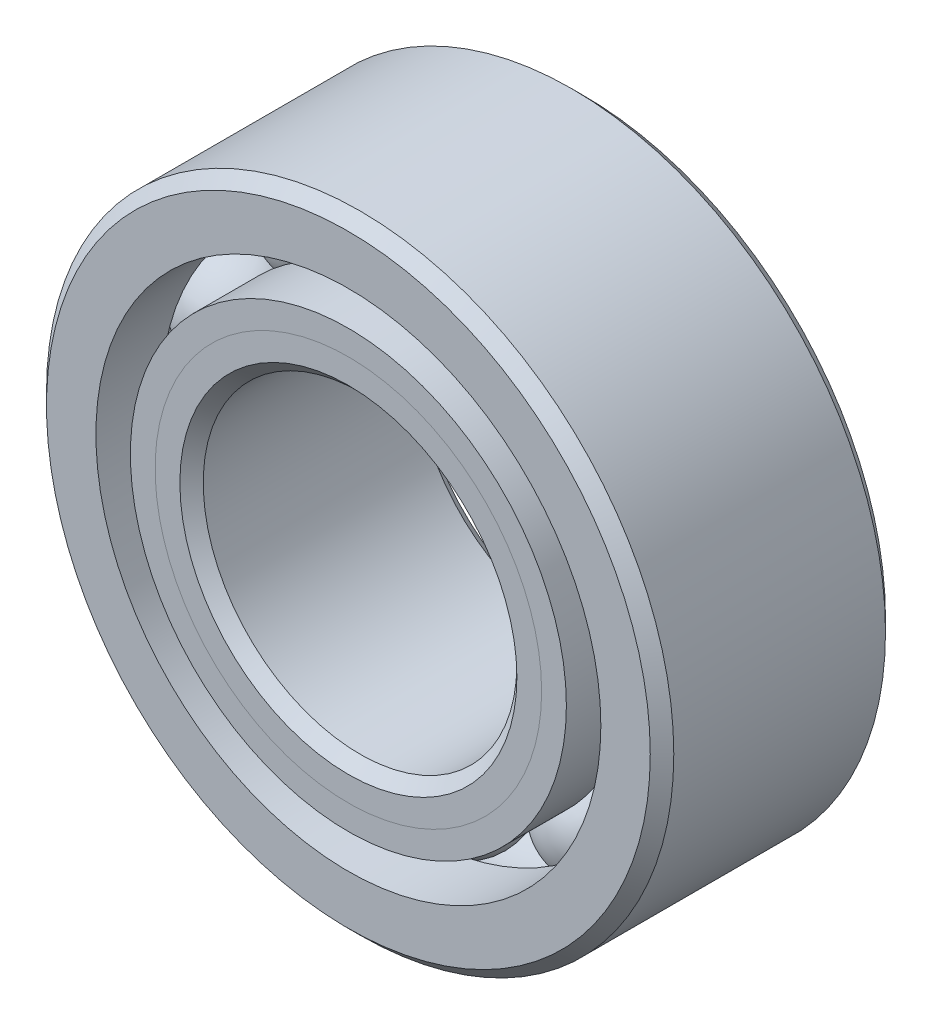
ISO-10303-21;
HEADER;
FILE_DESCRIPTION(('STEP AP214'),'2;1');
FILE_NAME('part.step','',(''),(''),'','','');
FILE_SCHEMA(('AUTOMOTIVE_DESIGN { 1 0 10303 214 1 1 1 1 }'));
ENDSEC;
DATA;
#1=APPLICATION_CONTEXT('core data for automotive mechanical design processes');
#2=APPLICATION_PROTOCOL_DEFINITION('international standard','automotive_design',2000,#1);
#3=PRODUCT_CONTEXT('',#1,'mechanical');
#4=PRODUCT('Part','Part','',(#3));
#5=PRODUCT_RELATED_PRODUCT_CATEGORY('part','',(#4));
#6=PRODUCT_DEFINITION_FORMATION('','',#4);
#7=PRODUCT_DEFINITION_CONTEXT('part definition',#1,'design');
#8=PRODUCT_DEFINITION('design','',#6,#7);
#9=PRODUCT_DEFINITION_SHAPE('','',#8);
#10=(LENGTH_UNIT() NAMED_UNIT(*) SI_UNIT(.MILLI.,.METRE.));
#11=(NAMED_UNIT(*) PLANE_ANGLE_UNIT() SI_UNIT($,.RADIAN.));
#12=(NAMED_UNIT(*) SI_UNIT($,.STERADIAN.) SOLID_ANGLE_UNIT());
#13=UNCERTAINTY_MEASURE_WITH_UNIT(LENGTH_MEASURE(1.E-05),#10,'distance_accuracy_value','');
#14=(GEOMETRIC_REPRESENTATION_CONTEXT(3) GLOBAL_UNCERTAINTY_ASSIGNED_CONTEXT((#13)) GLOBAL_UNIT_ASSIGNED_CONTEXT((#10,
#11,#12)) REPRESENTATION_CONTEXT('',''));
#15=CARTESIAN_POINT('',(0.,0.,0.));
#16=DIRECTION('',(0.,0.,1.));
#17=DIRECTION('',(1.,0.,0.));
#18=AXIS2_PLACEMENT_3D('',#15,#16,#17);
#19=CARTESIAN_POINT('',(-1.39966363202144,1.92647171785543,0.));
#20=DIRECTION('',(0.,0.,1.));
#21=DIRECTION('',(-0.587785252292463,0.809016994374955,0.));
#22=AXIS2_PLACEMENT_3D('',#19,#20,#21);
#23=SPHERICAL_SURFACE('',#22,0.557180720515983);
#24=CARTESIAN_POINT('',(-1.39966363202144,1.92647171785543,0.557180720515955));
#25=VERTEX_POINT('',#24);
#26=VERTEX_LOOP('',#25);
#27=FACE_BOUND('',#26,.T.);
#28=ADVANCED_FACE('F39',(#27),#23,.T.);
#29=CLOSED_SHELL('',(#28));
#30=MANIFOLD_SOLID_BREP('B2',#29);
#31=CARTESIAN_POINT('',(-2.26470332942782,0.735846717855385,0.));
#32=DIRECTION('',(0.,0.,1.));
#33=DIRECTION('',(-0.95105651629515,0.309016994374959,0.));
#34=AXIS2_PLACEMENT_3D('',#31,#32,#33);
#35=SPHERICAL_SURFACE('',#34,0.557180720515983);
#36=CARTESIAN_POINT('',(-2.26470332942782,0.735846717855384,0.557180720516003));
#37=VERTEX_POINT('',#36);
#38=VERTEX_LOOP('',#37);
#39=FACE_BOUND('',#38,.T.);
#40=ADVANCED_FACE('F70',(#39),#35,.T.);
#41=CLOSED_SHELL('',(#40));
#42=MANIFOLD_SOLID_BREP('B6',#41);
#43=CARTESIAN_POINT('',(-2.26470332942789,-0.73584671785526,0.));
#44=DIRECTION('',(0.,0.,0.999999999999999));
#45=DIRECTION('',(-0.951056516295157,-0.309016994374938,0.));
#46=AXIS2_PLACEMENT_3D('',#43,#44,#45);
#47=SPHERICAL_SURFACE('',#46,0.557180720515983);
#48=CARTESIAN_POINT('',(-2.26470332942789,-0.73584671785526,0.557180720515982));
#49=VERTEX_POINT('',#48);
#50=VERTEX_LOOP('',#49);
#51=FACE_BOUND('',#50,.T.);
#52=ADVANCED_FACE('F101',(#51),#47,.T.);
#53=CLOSED_SHELL('',(#52));
#54=MANIFOLD_SOLID_BREP('B35',#53);
#55=CARTESIAN_POINT('',(-1.39966363202149,-1.92647171785527,0.));
#56=DIRECTION('',(0.,0.,1.));
#57=DIRECTION('',(-0.58778525229248,-0.809016994374942,0.));
#58=AXIS2_PLACEMENT_3D('',#55,#56,#57);
#59=SPHERICAL_SURFACE('',#58,0.557180720515983);
#60=CARTESIAN_POINT('',(-1.39966363202149,-1.92647171785527,0.557180720515955));
#61=VERTEX_POINT('',#60);
#62=VERTEX_LOOP('',#61);
#63=FACE_BOUND('',#62,.T.);
#64=ADVANCED_FACE('F132',(#63),#59,.T.);
#65=CLOSED_SHELL('',(#64));
#66=MANIFOLD_SOLID_BREP('B66',#65);
#67=CARTESIAN_POINT('',(0.,-2.38124999999992,0.));
#68=DIRECTION('',(0.,0.,1.));
#69=DIRECTION('',(0.,-1.,0.));
#70=AXIS2_PLACEMENT_3D('',#67,#68,#69);
#71=SPHERICAL_SURFACE('',#70,0.557180720515983);
#72=CARTESIAN_POINT('',(0.,-2.38124999999992,0.557180720515955));
#73=VERTEX_POINT('',#72);
#74=VERTEX_LOOP('',#73);
#75=FACE_BOUND('',#74,.T.);
#76=ADVANCED_FACE('F163',(#75),#71,.T.);
#77=CLOSED_SHELL('',(#76));
#78=MANIFOLD_SOLID_BREP('B97',#77);
#79=CARTESIAN_POINT('',(1.39966363202143,-1.92647171785532,0.));
#80=DIRECTION('',(0.,0.,0.999999999999999));
#81=DIRECTION('',(0.587785252292469,-0.80901699437495,0.));
#82=AXIS2_PLACEMENT_3D('',#79,#80,#81);
#83=SPHERICAL_SURFACE('',#82,0.557180720515983);
#84=CARTESIAN_POINT('',(1.39966363202143,-1.92647171785532,0.557180720515955));
#85=VERTEX_POINT('',#84);
#86=VERTEX_LOOP('',#85);
#87=FACE_BOUND('',#86,.T.);
#88=ADVANCED_FACE('F194',(#87),#83,.T.);
#89=CLOSED_SHELL('',(#88));
#90=MANIFOLD_SOLID_BREP('B128',#89);
#91=CARTESIAN_POINT('',(2.26470332942782,-0.735846717855329,0.));
#92=DIRECTION('',(0.,0.,1.));
#93=DIRECTION('',(0.951056516295153,-0.309016994374952,0.));
#94=AXIS2_PLACEMENT_3D('',#91,#92,#93);
#95=SPHERICAL_SURFACE('',#94,0.557180720515983);
#96=CARTESIAN_POINT('',(2.26470332942782,-0.735846717855329,0.557180720515941));
#97=VERTEX_POINT('',#96);
#98=VERTEX_LOOP('',#97);
#99=FACE_BOUND('',#98,.T.);
#100=ADVANCED_FACE('F225',(#99),#95,.T.);
#101=CLOSED_SHELL('',(#100));
#102=MANIFOLD_SOLID_BREP('B159',#101);
#103=CARTESIAN_POINT('',(2.26470332942784,0.735846717855385,0.));
#104=DIRECTION('',(0.,0.,1.));
#105=DIRECTION('',(0.951056516295155,0.309016994374944,0.));
#106=AXIS2_PLACEMENT_3D('',#103,#104,#105);
#107=SPHERICAL_SURFACE('',#106,0.557180720515983);
#108=CARTESIAN_POINT('',(2.26470332942784,0.735846717855384,0.557180720515983));
#109=VERTEX_POINT('',#108);
#110=VERTEX_LOOP('',#109);
#111=FACE_BOUND('',#110,.T.);
#112=ADVANCED_FACE('F256',(#111),#107,.T.);
#113=CLOSED_SHELL('',(#112));
#114=MANIFOLD_SOLID_BREP('B190',#113);
#115=CARTESIAN_POINT('',(1.39966363202146,1.92647171785536,0.));
#116=DIRECTION('',(0.,0.,1.));
#117=DIRECTION('',(0.587785252292474,0.809016994374947,0.));
#118=AXIS2_PLACEMENT_3D('',#115,#116,#117);
#119=SPHERICAL_SURFACE('',#118,0.557180720515983);
#120=CARTESIAN_POINT('',(1.39966363202146,1.92647171785536,0.557180720515955));
#121=VERTEX_POINT('',#120);
#122=VERTEX_LOOP('',#121);
#123=FACE_BOUND('',#122,.T.);
#124=ADVANCED_FACE('F287',(#123),#119,.T.);
#125=CLOSED_SHELL('',(#124));
#126=MANIFOLD_SOLID_BREP('B221',#125);
#127=CARTESIAN_POINT('',(0.,2.38125000000003,0.));
#128=DIRECTION('',(0.,0.,1.));
#129=DIRECTION('',(0.,0.999999999999999,0.));
#130=AXIS2_PLACEMENT_3D('',#127,#128,#129);
#131=SPHERICAL_SURFACE('',#130,0.557180720515983);
#132=CARTESIAN_POINT('',(0.,2.38125000000003,0.557180720515996));
#133=VERTEX_POINT('',#132);
#134=VERTEX_LOOP('',#133);
#135=FACE_BOUND('',#134,.T.);
#136=ADVANCED_FACE('F320',(#135),#131,.T.);
#137=CLOSED_SHELL('',(#136));
#138=MANIFOLD_SOLID_BREP('B252',#137);
#139=CARTESIAN_POINT('',(0.,1.95629204514575,1.19062500000002));
#140=DIRECTION('',(0.,0.,-1.));
#141=DIRECTION('',(-1.,0.,0.));
#142=AXIS2_PLACEMENT_3D('',#139,#140,#141);
#143=PLANE('',#142);
#144=CARTESIAN_POINT('',(0.,0.,1.19062499999997));
#145=DIRECTION('',(0.,0.,1.));
#146=DIRECTION('',(1.,0.,0.));
#147=AXIS2_PLACEMENT_3D('',#144,#145,#146);
#148=CIRCLE('',#147,1.70578463974201);
#149=CARTESIAN_POINT('',(1.70578463974201,0.,1.19062499999997));
#150=VERTEX_POINT('',#149);
#151=EDGE_CURVE('E374',#150,#150,#148,.T.);
#152=ORIENTED_EDGE('',*,*,#151,.F.);
#153=EDGE_LOOP('',(#152));
#154=FACE_BOUND('',#153,.T.);
#155=CARTESIAN_POINT('',(0.,0.,1.19062499999997));
#156=DIRECTION('',(0.,0.,1.));
#157=DIRECTION('',(1.,0.,0.));
#158=AXIS2_PLACEMENT_3D('',#155,#156,#157);
#159=CIRCLE('',#158,1.95629204514573);
#160=CARTESIAN_POINT('',(1.95629204514573,0.,1.19062499999997));
#161=VERTEX_POINT('',#160);
#162=EDGE_CURVE('E319',#161,#161,#159,.T.);
#163=ORIENTED_EDGE('',*,*,#162,.T.);
#164=EDGE_LOOP('',(#163));
#165=FACE_BOUND('',#164,.T.);
#166=ADVANCED_FACE('F340',(#154,#165),#143,.F.);
#167=CARTESIAN_POINT('',(0.,0.,0.940117594596314));
#168=DIRECTION('',(0.,0.,1.));
#169=DIRECTION('',(1.,0.,0.));
#170=AXIS2_PLACEMENT_3D('',#167,#168,#169);
#171=CONICAL_SURFACE('',#170,1.70578463974201,0.78539816339745);
#172=ORIENTED_EDGE('',*,*,#162,.F.);
#173=EDGE_LOOP('',(#172));
#174=FACE_BOUND('',#173,.T.);
#175=CARTESIAN_POINT('',(0.,0.,0.940117594596314));
#176=DIRECTION('',(0.,0.,1.));
#177=DIRECTION('',(1.,0.,0.));
#178=AXIS2_PLACEMENT_3D('',#175,#176,#177);
#179=CIRCLE('',#178,1.70578463974201);
#180=CARTESIAN_POINT('',(1.705784639742,0.,0.940117594596314));
#181=VERTEX_POINT('',#180);
#182=EDGE_CURVE('E346',#181,#181,#179,.T.);
#183=ORIENTED_EDGE('',*,*,#182,.T.);
#184=EDGE_LOOP('',(#183));
#185=FACE_BOUND('',#184,.T.);
#186=ADVANCED_FACE('F381',(#174,#185),#171,.T.);
#187=CARTESIAN_POINT('',(0.,0.,1.19062499999997));
#188=DIRECTION('',(0.,0.,1.));
#189=DIRECTION('',(1.,0.,0.));
#190=AXIS2_PLACEMENT_3D('',#187,#188,#189);
#191=CYLINDRICAL_SURFACE('',#190,1.70578463974201);
#192=ORIENTED_EDGE('',*,*,#182,.F.);
#193=EDGE_LOOP('',(#192));
#194=FACE_BOUND('',#193,.T.);
#195=CARTESIAN_POINT('',(0.,0.,0.));
#196=DIRECTION('',(0.,0.,1.));
#197=DIRECTION('',(1.,0.,0.));
#198=AXIS2_PLACEMENT_3D('',#195,#196,#197);
#199=CIRCLE('',#198,1.70578463974201);
#200=CARTESIAN_POINT('',(1.70578463974201,0.,0.));
#201=VERTEX_POINT('',#200);
#202=EDGE_CURVE('E350',#201,#201,#199,.T.);
#203=ORIENTED_EDGE('',*,*,#202,.T.);
#204=EDGE_LOOP('',(#203));
#205=FACE_BOUND('',#204,.T.);
#206=ADVANCED_FACE('F385',(#194,#205),#191,.T.);
#207=CARTESIAN_POINT('',(0.,1.70578463974203,0.));
#208=DIRECTION('',(0.,0.,-1.));
#209=DIRECTION('',(-1.,0.,0.));
#210=AXIS2_PLACEMENT_3D('',#207,#208,#209);
#211=PLANE('',#210);
#212=ORIENTED_EDGE('',*,*,#202,.F.);
#213=EDGE_LOOP('',(#212));
#214=FACE_BOUND('',#213,.T.);
#215=CARTESIAN_POINT('',(0.,0.,0.));
#216=DIRECTION('',(0.,0.,1.));
#217=DIRECTION('',(1.,0.,0.));
#218=AXIS2_PLACEMENT_3D('',#215,#216,#217);
#219=CIRCLE('',#218,1.82406927948402);
#220=CARTESIAN_POINT('',(1.82406927948402,0.,0.));
#221=VERTEX_POINT('',#220);
#222=EDGE_CURVE('E354',#221,#221,#219,.T.);
#223=ORIENTED_EDGE('',*,*,#222,.T.);
#224=EDGE_LOOP('',(#223));
#225=FACE_BOUND('',#224,.T.);
#226=ADVANCED_FACE('F390',(#214,#225),#211,.F.);
#227=CARTESIAN_POINT('',(0.,0.,0.));
#228=DIRECTION('',(0.,0.,1.));
#229=DIRECTION('',(1.,0.,0.));
#230=AXIS2_PLACEMENT_3D('',#227,#228,#229);
#231=TOROIDAL_SURFACE('',#230,2.38125,0.557180720515983);
#232=ORIENTED_EDGE('',*,*,#222,.F.);
#233=EDGE_LOOP('',(#232));
#234=FACE_BOUND('',#233,.T.);
#235=CARTESIAN_POINT('',(0.,0.,-0.529166666666671));
#236=DIRECTION('',(0.,0.,1.));
#237=DIRECTION('',(1.,0.,0.));
#238=AXIS2_PLACEMENT_3D('',#235,#236,#237);
#239=CIRCLE('',#238,2.20679945054945);
#240=CARTESIAN_POINT('',(2.20679945054947,0.,-0.529166666666671));
#241=VERTEX_POINT('',#240);
#242=EDGE_CURVE('E359',#241,#241,#239,.T.);
#243=ORIENTED_EDGE('',*,*,#242,.T.);
#244=EDGE_LOOP('',(#243));
#245=FACE_BOUND('',#244,.T.);
#246=ADVANCED_FACE('F396',(#234,#245),#231,.F.);
#247=CARTESIAN_POINT('',(0.,0.,1.19062499999997));
#248=DIRECTION('',(0.,0.,1.));
#249=DIRECTION('',(1.,0.,0.));
#250=AXIS2_PLACEMENT_3D('',#247,#248,#249);
#251=CYLINDRICAL_SURFACE('',#250,2.20679945054945);
#252=ORIENTED_EDGE('',*,*,#242,.F.);
#253=EDGE_LOOP('',(#252));
#254=FACE_BOUND('',#253,.T.);
#255=CARTESIAN_POINT('',(0.,0.,-1.19062500000005));
#256=DIRECTION('',(0.,0.,1.));
#257=DIRECTION('',(1.,0.,0.));
#258=AXIS2_PLACEMENT_3D('',#255,#256,#257);
#259=CIRCLE('',#258,2.20679945054945);
#260=CARTESIAN_POINT('',(2.20679945054945,0.,-1.19062500000005));
#261=VERTEX_POINT('',#260);
#262=EDGE_CURVE('E362',#261,#261,#259,.T.);
#263=ORIENTED_EDGE('',*,*,#262,.T.);
#264=EDGE_LOOP('',(#263));
#265=FACE_BOUND('',#264,.T.);
#266=ADVANCED_FACE('F400',(#254,#265),#251,.T.);
#267=CARTESIAN_POINT('',(0.,1.70656250000004,-1.19062500000005));
#268=DIRECTION('',(0.,0.,1.));
#269=DIRECTION('',(1.,0.,0.));
#270=AXIS2_PLACEMENT_3D('',#267,#268,#269);
#271=PLANE('',#270);
#272=ORIENTED_EDGE('',*,*,#262,.F.);
#273=EDGE_LOOP('',(#272));
#274=FACE_BOUND('',#273,.T.);
#275=CARTESIAN_POINT('',(0.,0.,-1.19062500000005));
#276=DIRECTION('',(0.,0.,1.));
#277=DIRECTION('',(1.,0.,0.));
#278=AXIS2_PLACEMENT_3D('',#275,#276,#277);
#279=CIRCLE('',#278,1.7065625);
#280=CARTESIAN_POINT('',(1.7065625,0.,-1.19062500000005));
#281=VERTEX_POINT('',#280);
#282=EDGE_CURVE('E365',#281,#281,#279,.T.);
#283=ORIENTED_EDGE('',*,*,#282,.T.);
#284=EDGE_LOOP('',(#283));
#285=FACE_BOUND('',#284,.T.);
#286=ADVANCED_FACE('F404',(#274,#285),#271,.F.);
#287=CARTESIAN_POINT('',(0.,0.,-1.0715625));
#288=DIRECTION('',(0.,0.,-1.));
#289=DIRECTION('',(-1.,0.,0.));
#290=AXIS2_PLACEMENT_3D('',#287,#288,#289);
#291=CONICAL_SURFACE('',#290,1.5875,0.785398163397447);
#292=ORIENTED_EDGE('',*,*,#282,.F.);
#293=EDGE_LOOP('',(#292));
#294=FACE_BOUND('',#293,.T.);
#295=CARTESIAN_POINT('',(0.,0.,-1.0715625));
#296=DIRECTION('',(0.,0.,1.));
#297=DIRECTION('',(1.,0.,0.));
#298=AXIS2_PLACEMENT_3D('',#295,#296,#297);
#299=CIRCLE('',#298,1.5875);
#300=CARTESIAN_POINT('',(1.58749999999999,0.,-1.07156250000001));
#301=VERTEX_POINT('',#300);
#302=EDGE_CURVE('E368',#301,#301,#299,.T.);
#303=ORIENTED_EDGE('',*,*,#302,.T.);
#304=EDGE_LOOP('',(#303));
#305=FACE_BOUND('',#304,.T.);
#306=ADVANCED_FACE('F408',(#294,#305),#291,.F.);
#307=CARTESIAN_POINT('',(0.,0.,1.19062499999997));
#308=DIRECTION('',(0.,0.,1.));
#309=DIRECTION('',(1.,0.,0.));
#310=AXIS2_PLACEMENT_3D('',#307,#308,#309);
#311=CYLINDRICAL_SURFACE('',#310,1.5875);
#312=ORIENTED_EDGE('',*,*,#302,.F.);
#313=EDGE_LOOP('',(#312));
#314=FACE_BOUND('',#313,.T.);
#315=CARTESIAN_POINT('',(0.,0.,1.072340360258));
#316=DIRECTION('',(0.,0.,1.));
#317=DIRECTION('',(1.,0.,0.));
#318=AXIS2_PLACEMENT_3D('',#315,#316,#317);
#319=CIRCLE('',#318,1.5875);
#320=CARTESIAN_POINT('',(1.58750000000002,0.,1.07234036025799));
#321=VERTEX_POINT('',#320);
#322=EDGE_CURVE('E371',#321,#321,#319,.T.);
#323=ORIENTED_EDGE('',*,*,#322,.T.);
#324=EDGE_LOOP('',(#323));
#325=FACE_BOUND('',#324,.T.);
#326=ADVANCED_FACE('F412',(#314,#325),#311,.F.);
#327=CARTESIAN_POINT('',(0.,0.,1.19062499999997));
#328=DIRECTION('',(0.,0.,1.));
#329=DIRECTION('',(1.,0.,0.));
#330=AXIS2_PLACEMENT_3D('',#327,#328,#329);
#331=CONICAL_SURFACE('',#330,1.70578463974201,0.78539816339745);
#332=ORIENTED_EDGE('',*,*,#322,.F.);
#333=EDGE_LOOP('',(#332));
#334=FACE_BOUND('',#333,.T.);
#335=ORIENTED_EDGE('',*,*,#151,.T.);
#336=EDGE_LOOP('',(#335));
#337=FACE_BOUND('',#336,.T.);
#338=ADVANCED_FACE('F378',(#334,#337),#331,.F.);
#339=CLOSED_SHELL('',(#166,#186,#206,#226,#246,#266,#286,#306,#326,#338));
#340=MANIFOLD_SOLID_BREP('B283',#339);
#341=CARTESIAN_POINT('',(0.,2.20679945054957,1.19062500000001));
#342=DIRECTION('',(0.,0.,-1.));
#343=DIRECTION('',(-1.,0.,0.));
#344=AXIS2_PLACEMENT_3D('',#341,#342,#343);
#345=PLANE('',#344);
#346=CARTESIAN_POINT('',(0.,0.,1.19062499999996));
#347=DIRECTION('',(0.,0.,1.));
#348=DIRECTION('',(1.,0.,0.));
#349=AXIS2_PLACEMENT_3D('',#346,#347,#348);
#350=CIRCLE('',#349,1.95629204514573);
#351=CARTESIAN_POINT('',(1.95629204514574,0.,1.19062499999996));
#352=VERTEX_POINT('',#351);
#353=EDGE_CURVE('E339',#352,#352,#350,.T.);
#354=ORIENTED_EDGE('',*,*,#353,.F.);
#355=EDGE_LOOP('',(#354));
#356=FACE_BOUND('',#355,.T.);
#357=CARTESIAN_POINT('',(0.,0.,1.19062499999996));
#358=DIRECTION('',(0.,0.,1.));
#359=DIRECTION('',(1.,0.,0.));
#360=AXIS2_PLACEMENT_3D('',#357,#358,#359);
#361=CIRCLE('',#360,2.20679945054945);
#362=CARTESIAN_POINT('',(2.20679945054946,0.,1.19062499999996));
#363=VERTEX_POINT('',#362);
#364=EDGE_CURVE('E520',#363,#363,#361,.T.);
#365=ORIENTED_EDGE('',*,*,#364,.T.);
#366=EDGE_LOOP('',(#365));
#367=FACE_BOUND('',#366,.T.);
#368=ADVANCED_FACE('F498',(#356,#367),#345,.F.);
#369=CARTESIAN_POINT('',(0.,0.,1.19062499999996));
#370=DIRECTION('',(0.,0.,1.));
#371=DIRECTION('',(1.,0.,0.));
#372=AXIS2_PLACEMENT_3D('',#369,#370,#371);
#373=CONICAL_SURFACE('',#372,1.95629204514573,0.78539816339745);
#374=CARTESIAN_POINT('',(0.,0.,0.940117594596321));
#375=DIRECTION('',(0.,0.,1.));
#376=DIRECTION('',(1.,0.,0.));
#377=AXIS2_PLACEMENT_3D('',#374,#375,#376);
#378=CIRCLE('',#377,1.70578463974201);
#379=CARTESIAN_POINT('',(1.70578463974202,0.,0.940117594596321));
#380=VERTEX_POINT('',#379);
#381=EDGE_CURVE('E504',#380,#380,#378,.T.);
#382=ORIENTED_EDGE('',*,*,#381,.F.);
#383=EDGE_LOOP('',(#382));
#384=FACE_BOUND('',#383,.T.);
#385=ORIENTED_EDGE('',*,*,#353,.T.);
#386=EDGE_LOOP('',(#385));
#387=FACE_BOUND('',#386,.T.);
#388=ADVANCED_FACE('F545',(#384,#387),#373,.F.);
#389=CARTESIAN_POINT('',(0.,0.,1.19062499999996));
#390=DIRECTION('',(0.,0.,1.));
#391=DIRECTION('',(1.,0.,0.));
#392=AXIS2_PLACEMENT_3D('',#389,#390,#391);
#393=CYLINDRICAL_SURFACE('',#392,1.70578463974201);
#394=CARTESIAN_POINT('',(0.,0.,0.));
#395=DIRECTION('',(0.,0.,1.));
#396=DIRECTION('',(1.,0.,0.));
#397=AXIS2_PLACEMENT_3D('',#394,#395,#396);
#398=CIRCLE('',#397,1.70578463974201);
#399=CARTESIAN_POINT('',(1.70578463974201,0.,0.));
#400=VERTEX_POINT('',#399);
#401=EDGE_CURVE('E508',#400,#400,#398,.T.);
#402=ORIENTED_EDGE('',*,*,#401,.F.);
#403=EDGE_LOOP('',(#402));
#404=FACE_BOUND('',#403,.T.);
#405=ORIENTED_EDGE('',*,*,#381,.T.);
#406=EDGE_LOOP('',(#405));
#407=FACE_BOUND('',#406,.T.);
#408=ADVANCED_FACE('F540',(#404,#407),#393,.F.);
#409=CARTESIAN_POINT('',(0.,1.70578463974208,0.));
#410=DIRECTION('',(0.,0.,1.));
#411=DIRECTION('',(1.,0.,0.));
#412=AXIS2_PLACEMENT_3D('',#409,#410,#411);
#413=PLANE('',#412);
#414=CARTESIAN_POINT('',(0.,0.,0.));
#415=DIRECTION('',(0.,0.,1.));
#416=DIRECTION('',(1.,0.,0.));
#417=AXIS2_PLACEMENT_3D('',#414,#415,#416);
#418=CIRCLE('',#417,1.82406927948402);
#419=CARTESIAN_POINT('',(1.82406927948402,0.,0.));
#420=VERTEX_POINT('',#419);
#421=EDGE_CURVE('E512',#420,#420,#418,.T.);
#422=ORIENTED_EDGE('',*,*,#421,.F.);
#423=EDGE_LOOP('',(#422));
#424=FACE_BOUND('',#423,.T.);
#425=ORIENTED_EDGE('',*,*,#401,.T.);
#426=EDGE_LOOP('',(#425));
#427=FACE_BOUND('',#426,.T.);
#428=ADVANCED_FACE('F534',(#424,#427),#413,.F.);
#429=CARTESIAN_POINT('',(0.,0.,0.));
#430=DIRECTION('',(0.,0.,1.));
#431=DIRECTION('',(1.,0.,0.));
#432=AXIS2_PLACEMENT_3D('',#429,#430,#431);
#433=TOROIDAL_SURFACE('',#432,2.38125,0.557180720515983);
#434=CARTESIAN_POINT('',(0.,0.,0.52916666666665));
#435=DIRECTION('',(0.,0.,1.));
#436=DIRECTION('',(1.,0.,0.));
#437=AXIS2_PLACEMENT_3D('',#434,#435,#436);
#438=CIRCLE('',#437,2.20679945054945);
#439=CARTESIAN_POINT('',(2.20679945054949,0.,0.52916666666665));
#440=VERTEX_POINT('',#439);
#441=EDGE_CURVE('E517',#440,#440,#438,.T.);
#442=ORIENTED_EDGE('',*,*,#441,.F.);
#443=EDGE_LOOP('',(#442));
#444=FACE_BOUND('',#443,.T.);
#445=ORIENTED_EDGE('',*,*,#421,.T.);
#446=EDGE_LOOP('',(#445));
#447=FACE_BOUND('',#446,.T.);
#448=ADVANCED_FACE('F528',(#444,#447),#433,.F.);
#449=CARTESIAN_POINT('',(0.,0.,1.19062499999996));
#450=DIRECTION('',(0.,0.,1.));
#451=DIRECTION('',(1.,0.,0.));
#452=AXIS2_PLACEMENT_3D('',#449,#450,#451);
#453=CYLINDRICAL_SURFACE('',#452,2.20679945054945);
#454=ORIENTED_EDGE('',*,*,#364,.F.);
#455=EDGE_LOOP('',(#454));
#456=FACE_BOUND('',#455,.T.);
#457=ORIENTED_EDGE('',*,*,#441,.T.);
#458=EDGE_LOOP('',(#457));
#459=FACE_BOUND('',#458,.T.);
#460=ADVANCED_FACE('F525',(#456,#459),#453,.T.);
#461=CLOSED_SHELL('',(#368,#388,#408,#428,#448,#460));
#462=MANIFOLD_SOLID_BREP('B314',#461);
#463=CARTESIAN_POINT('',(0.,0.,1.07156250000001));
#464=DIRECTION('',(0.,0.,-1.));
#465=DIRECTION('',(-1.,0.,0.));
#466=AXIS2_PLACEMENT_3D('',#463,#464,#465);
#467=CONICAL_SURFACE('',#466,3.175,0.785398163397449);
#468=CARTESIAN_POINT('',(0.,0.,1.19062500000004));
#469=DIRECTION('',(0.,0.,1.));
#470=DIRECTION('',(1.,0.,0.));
#471=AXIS2_PLACEMENT_3D('',#468,#469,#470);
#472=CIRCLE('',#471,3.0559375);
#473=CARTESIAN_POINT('',(3.05593750000001,0.,1.19062500000004));
#474=VERTEX_POINT('',#473);
#475=EDGE_CURVE('E617',#474,#474,#472,.T.);
#476=ORIENTED_EDGE('',*,*,#475,.F.);
#477=EDGE_LOOP('',(#476));
#478=FACE_BOUND('',#477,.T.);
#479=CARTESIAN_POINT('',(0.,0.,1.07156250000001));
#480=DIRECTION('',(0.,0.,1.));
#481=DIRECTION('',(1.,0.,0.));
#482=AXIS2_PLACEMENT_3D('',#479,#480,#481);
#483=CIRCLE('',#482,3.175);
#484=CARTESIAN_POINT('',(3.17500000000001,0.,1.07156250000001));
#485=VERTEX_POINT('',#484);
#486=EDGE_CURVE('E497',#485,#485,#483,.T.);
#487=ORIENTED_EDGE('',*,*,#486,.T.);
#488=EDGE_LOOP('',(#487));
#489=FACE_BOUND('',#488,.T.);
#490=ADVANCED_FACE('F589',(#478,#489),#467,.T.);
#491=CARTESIAN_POINT('',(0.,0.,1.19062500000004));
#492=DIRECTION('',(0.,0.,1.));
#493=DIRECTION('',(1.,0.,0.));
#494=AXIS2_PLACEMENT_3D('',#491,#492,#493);
#495=CYLINDRICAL_SURFACE('',#494,3.175);
#496=ORIENTED_EDGE('',*,*,#486,.F.);
#497=EDGE_LOOP('',(#496));
#498=FACE_BOUND('',#497,.T.);
#499=CARTESIAN_POINT('',(0.,0.,-1.0715624999999));
#500=DIRECTION('',(0.,0.,1.));
#501=DIRECTION('',(1.,0.,0.));
#502=AXIS2_PLACEMENT_3D('',#499,#500,#501);
#503=CIRCLE('',#502,3.175);
#504=CARTESIAN_POINT('',(3.17500000000001,0.,-1.0715624999999));
#505=VERTEX_POINT('',#504);
#506=EDGE_CURVE('E595',#505,#505,#503,.T.);
#507=ORIENTED_EDGE('',*,*,#506,.T.);
#508=EDGE_LOOP('',(#507));
#509=FACE_BOUND('',#508,.T.);
#510=ADVANCED_FACE('F624',(#498,#509),#495,.T.);
#511=CARTESIAN_POINT('',(0.,0.,-1.19062500000001));
#512=DIRECTION('',(0.,0.,1.));
#513=DIRECTION('',(1.,0.,0.));
#514=AXIS2_PLACEMENT_3D('',#511,#512,#513);
#515=CONICAL_SURFACE('',#514,3.0559375,0.785398163397448);
#516=ORIENTED_EDGE('',*,*,#506,.F.);
#517=EDGE_LOOP('',(#516));
#518=FACE_BOUND('',#517,.T.);
#519=CARTESIAN_POINT('',(0.,0.,-1.19062500000001));
#520=DIRECTION('',(0.,0.,1.));
#521=DIRECTION('',(1.,0.,0.));
#522=AXIS2_PLACEMENT_3D('',#519,#520,#521);
#523=CIRCLE('',#522,3.0559375);
#524=CARTESIAN_POINT('',(3.05593749999994,0.,-1.19062500000001));
#525=VERTEX_POINT('',#524);
#526=EDGE_CURVE('E599',#525,#525,#523,.T.);
#527=ORIENTED_EDGE('',*,*,#526,.T.);
#528=EDGE_LOOP('',(#527));
#529=FACE_BOUND('',#528,.T.);
#530=ADVANCED_FACE('F628',(#518,#529),#515,.T.);
#531=CARTESIAN_POINT('',(0.,3.05593750000004,-1.19062500000001));
#532=DIRECTION('',(0.,0.,1.));
#533=DIRECTION('',(1.,0.,0.));
#534=AXIS2_PLACEMENT_3D('',#531,#532,#533);
#535=PLANE('',#534);
#536=ORIENTED_EDGE('',*,*,#526,.F.);
#537=EDGE_LOOP('',(#536));
#538=FACE_BOUND('',#537,.T.);
#539=CARTESIAN_POINT('',(0.,0.,-1.19062500000001));
#540=DIRECTION('',(0.,0.,1.));
#541=DIRECTION('',(1.,0.,0.));
#542=AXIS2_PLACEMENT_3D('',#539,#540,#541);
#543=CIRCLE('',#542,2.55570054945055);
#544=CARTESIAN_POINT('',(2.55570054945049,0.,-1.19062500000001));
#545=VERTEX_POINT('',#544);
#546=EDGE_CURVE('E603',#545,#545,#543,.T.);
#547=ORIENTED_EDGE('',*,*,#546,.T.);
#548=EDGE_LOOP('',(#547));
#549=FACE_BOUND('',#548,.T.);
#550=ADVANCED_FACE('F633',(#538,#549),#535,.F.);
#551=CARTESIAN_POINT('',(0.,0.,1.19062500000004));
#552=DIRECTION('',(0.,0.,1.));
#553=DIRECTION('',(1.,0.,0.));
#554=AXIS2_PLACEMENT_3D('',#551,#552,#553);
#555=CYLINDRICAL_SURFACE('',#554,2.55570054945055);
#556=ORIENTED_EDGE('',*,*,#546,.F.);
#557=EDGE_LOOP('',(#556));
#558=FACE_BOUND('',#557,.T.);
#559=CARTESIAN_POINT('',(0.,0.,-0.529166666666678));
#560=DIRECTION('',(0.,0.,1.));
#561=DIRECTION('',(1.,0.,0.));
#562=AXIS2_PLACEMENT_3D('',#559,#560,#561);
#563=CIRCLE('',#562,2.55570054945055);
#564=CARTESIAN_POINT('',(2.55570054945053,0.,-0.529166666666678));
#565=VERTEX_POINT('',#564);
#566=EDGE_CURVE('E608',#565,#565,#563,.T.);
#567=ORIENTED_EDGE('',*,*,#566,.T.);
#568=EDGE_LOOP('',(#567));
#569=FACE_BOUND('',#568,.T.);
#570=ADVANCED_FACE('F639',(#558,#569),#555,.F.);
#571=CARTESIAN_POINT('',(0.,0.,0.));
#572=DIRECTION('',(0.,0.,1.));
#573=DIRECTION('',(1.,0.,0.));
#574=AXIS2_PLACEMENT_3D('',#571,#572,#573);
#575=TOROIDAL_SURFACE('',#574,2.38125,0.557180720515983);
#576=ORIENTED_EDGE('',*,*,#566,.F.);
#577=EDGE_LOOP('',(#576));
#578=FACE_BOUND('',#577,.T.);
#579=CARTESIAN_POINT('',(0.,0.,0.529166666666692));
#580=DIRECTION('',(0.,0.,1.));
#581=DIRECTION('',(1.,0.,0.));
#582=AXIS2_PLACEMENT_3D('',#579,#580,#581);
#583=CIRCLE('',#582,2.55570054945055);
#584=CARTESIAN_POINT('',(2.55570054945055,0.,0.529166666666692));
#585=VERTEX_POINT('',#584);
#586=EDGE_CURVE('E611',#585,#585,#583,.T.);
#587=ORIENTED_EDGE('',*,*,#586,.T.);
#588=EDGE_LOOP('',(#587));
#589=FACE_BOUND('',#588,.T.);
#590=ADVANCED_FACE('F643',(#578,#589),#575,.F.);
#591=CARTESIAN_POINT('',(0.,0.,1.19062500000004));
#592=DIRECTION('',(0.,0.,1.));
#593=DIRECTION('',(1.,0.,0.));
#594=AXIS2_PLACEMENT_3D('',#591,#592,#593);
#595=CYLINDRICAL_SURFACE('',#594,2.55570054945055);
#596=ORIENTED_EDGE('',*,*,#586,.F.);
#597=EDGE_LOOP('',(#596));
#598=FACE_BOUND('',#597,.T.);
#599=CARTESIAN_POINT('',(0.,0.,1.19062500000004));
#600=DIRECTION('',(0.,0.,1.));
#601=DIRECTION('',(1.,0.,0.));
#602=AXIS2_PLACEMENT_3D('',#599,#600,#601);
#603=CIRCLE('',#602,2.55570054945055);
#604=CARTESIAN_POINT('',(2.55570054945056,0.,1.19062500000004));
#605=VERTEX_POINT('',#604);
#606=EDGE_CURVE('E614',#605,#605,#603,.T.);
#607=ORIENTED_EDGE('',*,*,#606,.T.);
#608=EDGE_LOOP('',(#607));
#609=FACE_BOUND('',#608,.T.);
#610=ADVANCED_FACE('F647',(#598,#609),#595,.F.);
#611=CARTESIAN_POINT('',(0.,3.05593750000004,1.19062500000001));
#612=DIRECTION('',(0.,0.,-1.));
#613=DIRECTION('',(-1.,0.,0.));
#614=AXIS2_PLACEMENT_3D('',#611,#612,#613);
#615=PLANE('',#614);
#616=ORIENTED_EDGE('',*,*,#606,.F.);
#617=EDGE_LOOP('',(#616));
#618=FACE_BOUND('',#617,.T.);
#619=ORIENTED_EDGE('',*,*,#475,.T.);
#620=EDGE_LOOP('',(#619));
#621=FACE_BOUND('',#620,.T.);
#622=ADVANCED_FACE('F621',(#618,#621),#615,.F.);
#623=CLOSED_SHELL('',(#490,#510,#530,#550,#570,#590,#610,#622));
#624=MANIFOLD_SOLID_BREP('B334',#623);
#625=ADVANCED_BREP_SHAPE_REPRESENTATION('',(#18,#30,#42,#54,#66,#78,#90,#102,#114,#126,#138,
#340,#462,#624),#14);
#626=SHAPE_DEFINITION_REPRESENTATION(#9,#625);
ENDSEC;
END-ISO-10303-21;
